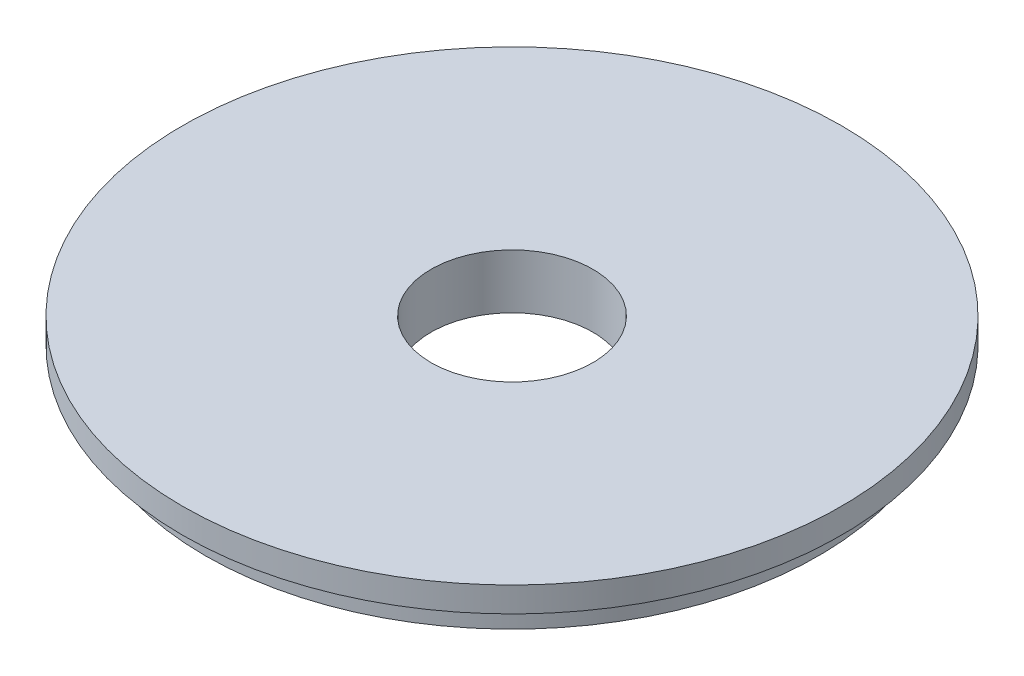
ISO-10303-21;
HEADER;
FILE_DESCRIPTION(('STEP AP214'),'2;1');
FILE_NAME('part.step','',(''),(''),'','','');
FILE_SCHEMA(('AUTOMOTIVE_DESIGN { 1 0 10303 214 1 1 1 1 }'));
ENDSEC;
DATA;
#1=APPLICATION_CONTEXT('core data for automotive mechanical design processes');
#2=APPLICATION_PROTOCOL_DEFINITION('international standard','automotive_design',2000,#1);
#3=PRODUCT_CONTEXT('',#1,'mechanical');
#4=PRODUCT('Part','Part','',(#3));
#5=PRODUCT_RELATED_PRODUCT_CATEGORY('part','',(#4));
#6=PRODUCT_DEFINITION_FORMATION('','',#4);
#7=PRODUCT_DEFINITION_CONTEXT('part definition',#1,'design');
#8=PRODUCT_DEFINITION('design','',#6,#7);
#9=PRODUCT_DEFINITION_SHAPE('','',#8);
#10=(LENGTH_UNIT() NAMED_UNIT(*) SI_UNIT(.MILLI.,.METRE.));
#11=(NAMED_UNIT(*) PLANE_ANGLE_UNIT() SI_UNIT($,.RADIAN.));
#12=(NAMED_UNIT(*) SI_UNIT($,.STERADIAN.) SOLID_ANGLE_UNIT());
#13=UNCERTAINTY_MEASURE_WITH_UNIT(LENGTH_MEASURE(1.E-05),#10,'distance_accuracy_value','');
#14=(GEOMETRIC_REPRESENTATION_CONTEXT(3) GLOBAL_UNCERTAINTY_ASSIGNED_CONTEXT((#13)) GLOBAL_UNIT_ASSIGNED_CONTEXT((#10,
#11,#12)) REPRESENTATION_CONTEXT('',''));
#15=CARTESIAN_POINT('',(0.,0.,0.));
#16=DIRECTION('',(0.,0.,1.));
#17=DIRECTION('',(1.,0.,0.));
#18=AXIS2_PLACEMENT_3D('',#15,#16,#17);
#19=CARTESIAN_POINT('',(0.,0.,0.));
#20=DIRECTION('',(0.,1.,0.));
#21=DIRECTION('',(0.,0.,1.));
#22=AXIS2_PLACEMENT_3D('',#19,#20,#21);
#23=CYLINDRICAL_SURFACE('',#22,11.3157);
#24=CARTESIAN_POINT('',(0.,0.,0.));
#25=DIRECTION('',(0.,1.,0.));
#26=DIRECTION('',(0.,0.,1.));
#27=AXIS2_PLACEMENT_3D('',#24,#25,#26);
#28=CIRCLE('',#27,11.3157);
#29=CARTESIAN_POINT('',(0.,0.,11.3157));
#30=VERTEX_POINT('',#29);
#31=EDGE_CURVE('E10',#30,#30,#28,.T.);
#32=ORIENTED_EDGE('',*,*,#31,.T.);
#33=EDGE_LOOP('',(#32));
#34=FACE_BOUND('',#33,.T.);
#35=CARTESIAN_POINT('',(0.,-7.61999999999996,0.));
#36=DIRECTION('',(0.,1.,0.));
#37=DIRECTION('',(0.,0.,1.));
#38=AXIS2_PLACEMENT_3D('',#35,#36,#37);
#39=CIRCLE('',#38,11.3157);
#40=CARTESIAN_POINT('',(0.,-7.61999999999996,11.3157));
#41=VERTEX_POINT('',#40);
#42=EDGE_CURVE('E52',#41,#41,#39,.T.);
#43=ORIENTED_EDGE('',*,*,#42,.F.);
#44=EDGE_LOOP('',(#43));
#45=FACE_BOUND('',#44,.T.);
#46=ADVANCED_FACE('F30',(#34,#45),#23,.F.);
#47=CARTESIAN_POINT('',(-11.3157,0.,0.));
#48=DIRECTION('',(0.,1.,0.));
#49=DIRECTION('',(0.,0.,1.));
#50=AXIS2_PLACEMENT_3D('',#47,#48,#49);
#51=PLANE('',#50);
#52=CARTESIAN_POINT('',(0.,0.,0.));
#53=DIRECTION('',(0.,1.,0.));
#54=DIRECTION('',(0.,0.,1.));
#55=AXIS2_PLACEMENT_3D('',#52,#53,#54);
#56=CIRCLE('',#55,46.0756);
#57=CARTESIAN_POINT('',(0.,0.,46.0756));
#58=VERTEX_POINT('',#57);
#59=EDGE_CURVE('E36',#58,#58,#56,.T.);
#60=ORIENTED_EDGE('',*,*,#59,.T.);
#61=EDGE_LOOP('',(#60));
#62=FACE_BOUND('',#61,.T.);
#63=ORIENTED_EDGE('',*,*,#31,.F.);
#64=EDGE_LOOP('',(#63));
#65=FACE_BOUND('',#64,.T.);
#66=ADVANCED_FACE('F60',(#62,#65),#51,.T.);
#67=CARTESIAN_POINT('',(0.,0.,0.));
#68=DIRECTION('',(0.,1.,0.));
#69=DIRECTION('',(0.,0.,1.));
#70=AXIS2_PLACEMENT_3D('',#67,#68,#69);
#71=CYLINDRICAL_SURFACE('',#70,46.0756);
#72=CARTESIAN_POINT('',(0.,-3.50519999999999,0.));
#73=DIRECTION('',(0.,1.,0.));
#74=DIRECTION('',(0.,0.,1.));
#75=AXIS2_PLACEMENT_3D('',#72,#73,#74);
#76=CIRCLE('',#75,46.0756);
#77=CARTESIAN_POINT('',(0.,-3.50519999999999,46.0756));
#78=VERTEX_POINT('',#77);
#79=EDGE_CURVE('E40',#78,#78,#76,.T.);
#80=ORIENTED_EDGE('',*,*,#79,.T.);
#81=EDGE_LOOP('',(#80));
#82=FACE_BOUND('',#81,.T.);
#83=ORIENTED_EDGE('',*,*,#59,.F.);
#84=EDGE_LOOP('',(#83));
#85=FACE_BOUND('',#84,.T.);
#86=ADVANCED_FACE('F64',(#82,#85),#71,.T.);
#87=CARTESIAN_POINT('',(-46.0756,-3.50519999999999,0.));
#88=DIRECTION('',(0.,-1.,0.));
#89=DIRECTION('',(0.,0.,-1.));
#90=AXIS2_PLACEMENT_3D('',#87,#88,#89);
#91=PLANE('',#90);
#92=CARTESIAN_POINT('',(0.,-3.50519999999999,0.));
#93=DIRECTION('',(0.,1.,0.));
#94=DIRECTION('',(0.,0.,1.));
#95=AXIS2_PLACEMENT_3D('',#92,#93,#94);
#96=CIRCLE('',#95,42.8625);
#97=CARTESIAN_POINT('',(0.,-3.50519999999999,42.8625));
#98=VERTEX_POINT('',#97);
#99=EDGE_CURVE('E44',#98,#98,#96,.T.);
#100=ORIENTED_EDGE('',*,*,#99,.T.);
#101=EDGE_LOOP('',(#100));
#102=FACE_BOUND('',#101,.T.);
#103=ORIENTED_EDGE('',*,*,#79,.F.);
#104=EDGE_LOOP('',(#103));
#105=FACE_BOUND('',#104,.T.);
#106=ADVANCED_FACE('F68',(#102,#105),#91,.T.);
#107=CARTESIAN_POINT('',(0.,0.,0.));
#108=DIRECTION('',(0.,1.,0.));
#109=DIRECTION('',(0.,0.,1.));
#110=AXIS2_PLACEMENT_3D('',#107,#108,#109);
#111=CYLINDRICAL_SURFACE('',#110,42.8625);
#112=CARTESIAN_POINT('',(0.,-7.61999999999996,0.));
#113=DIRECTION('',(0.,1.,0.));
#114=DIRECTION('',(0.,0.,1.));
#115=AXIS2_PLACEMENT_3D('',#112,#113,#114);
#116=CIRCLE('',#115,42.8625);
#117=CARTESIAN_POINT('',(0.,-7.61999999999996,42.8625));
#118=VERTEX_POINT('',#117);
#119=EDGE_CURVE('E49',#118,#118,#116,.T.);
#120=ORIENTED_EDGE('',*,*,#119,.T.);
#121=EDGE_LOOP('',(#120));
#122=FACE_BOUND('',#121,.T.);
#123=ORIENTED_EDGE('',*,*,#99,.F.);
#124=EDGE_LOOP('',(#123));
#125=FACE_BOUND('',#124,.T.);
#126=ADVANCED_FACE('F75',(#122,#125),#111,.T.);
#127=CARTESIAN_POINT('',(-42.8625,-7.61999999999996,0.));
#128=DIRECTION('',(0.,-1.,0.));
#129=DIRECTION('',(0.,0.,-1.));
#130=AXIS2_PLACEMENT_3D('',#127,#128,#129);
#131=PLANE('',#130);
#132=ORIENTED_EDGE('',*,*,#42,.T.);
#133=EDGE_LOOP('',(#132));
#134=FACE_BOUND('',#133,.T.);
#135=ORIENTED_EDGE('',*,*,#119,.F.);
#136=EDGE_LOOP('',(#135));
#137=FACE_BOUND('',#136,.T.);
#138=ADVANCED_FACE('F56',(#134,#137),#131,.T.);
#139=CLOSED_SHELL('',(#46,#66,#86,#106,#126,#138));
#140=MANIFOLD_SOLID_BREP('B2',#139);
#141=ADVANCED_BREP_SHAPE_REPRESENTATION('',(#18,#140),#14);
#142=SHAPE_DEFINITION_REPRESENTATION(#9,#141);
ENDSEC;
END-ISO-10303-21;
